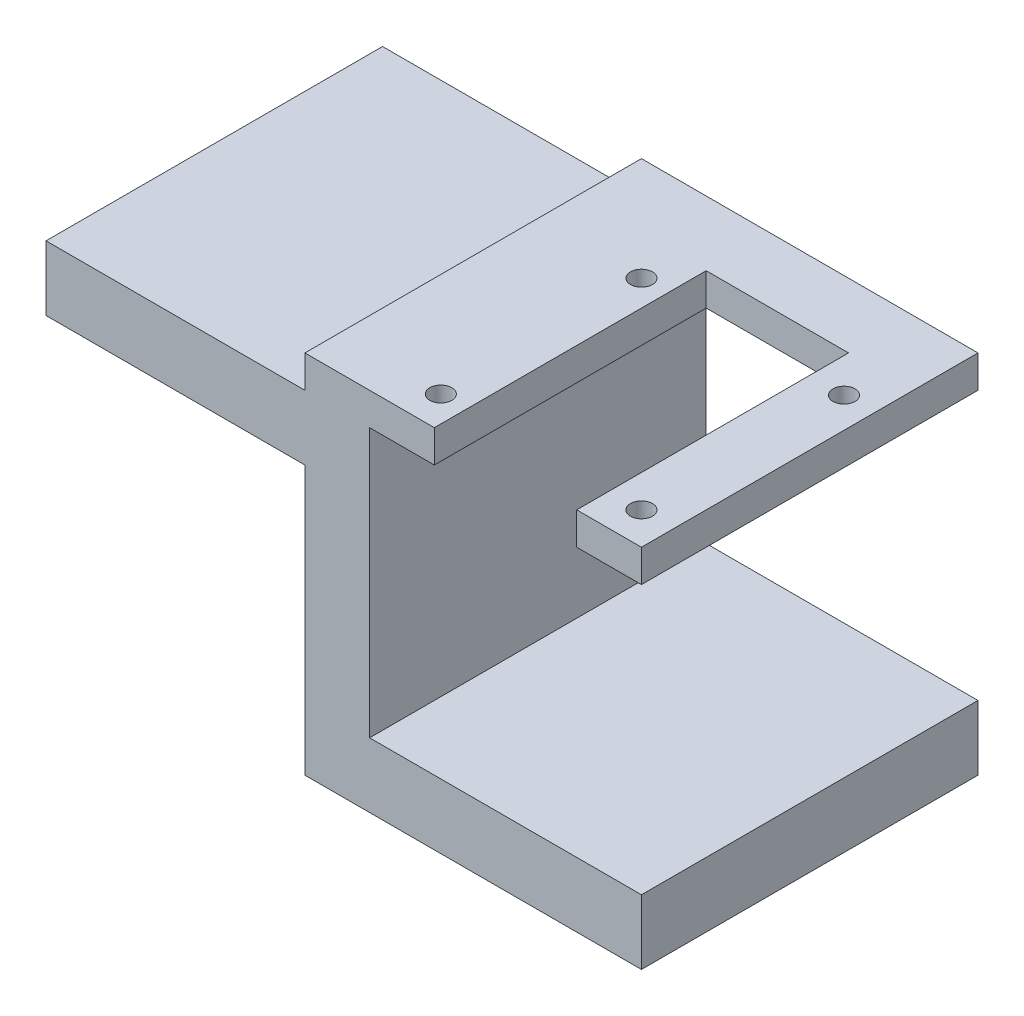
ISO-10303-21;
HEADER;
FILE_DESCRIPTION(('STEP AP214'),'2;1');
FILE_NAME('part.step','',(''),(''),'','','');
FILE_SCHEMA(('AUTOMOTIVE_DESIGN { 1 0 10303 214 1 1 1 1 }'));
ENDSEC;
DATA;
#1=APPLICATION_CONTEXT('core data for automotive mechanical design processes');
#2=APPLICATION_PROTOCOL_DEFINITION('international standard','automotive_design',2000,#1);
#3=PRODUCT_CONTEXT('',#1,'mechanical');
#4=PRODUCT('Part','Part','',(#3));
#5=PRODUCT_RELATED_PRODUCT_CATEGORY('part','',(#4));
#6=PRODUCT_DEFINITION_FORMATION('','',#4);
#7=PRODUCT_DEFINITION_CONTEXT('part definition',#1,'design');
#8=PRODUCT_DEFINITION('design','',#6,#7);
#9=PRODUCT_DEFINITION_SHAPE('','',#8);
#10=(LENGTH_UNIT() NAMED_UNIT(*) SI_UNIT(.MILLI.,.METRE.));
#11=(NAMED_UNIT(*) PLANE_ANGLE_UNIT() SI_UNIT($,.RADIAN.));
#12=(NAMED_UNIT(*) SI_UNIT($,.STERADIAN.) SOLID_ANGLE_UNIT());
#13=UNCERTAINTY_MEASURE_WITH_UNIT(LENGTH_MEASURE(1.E-05),#10,'distance_accuracy_value','');
#14=(GEOMETRIC_REPRESENTATION_CONTEXT(3) GLOBAL_UNCERTAINTY_ASSIGNED_CONTEXT((#13)) GLOBAL_UNIT_ASSIGNED_CONTEXT((#10,
#11,#12)) REPRESENTATION_CONTEXT('',''));
#15=CARTESIAN_POINT('',(0.,0.,0.));
#16=DIRECTION('',(0.,0.,1.));
#17=DIRECTION('',(1.,0.,0.));
#18=AXIS2_PLACEMENT_3D('',#15,#16,#17);
#19=CARTESIAN_POINT('',(-65.,0.,10.));
#20=DIRECTION('',(-1.,0.,0.));
#21=DIRECTION('',(0.,0.,1.));
#22=AXIS2_PLACEMENT_3D('',#19,#20,#21);
#23=PLANE('',#22);
#24=DIRECTION('',(0.,1.,0.));
#25=VECTOR('',#24,1.);
#26=CARTESIAN_POINT('',(-65.,0.,0.));
#27=LINE('',#26,#25);
#28=CARTESIAN_POINT('',(-65.,-35.,0.));
#29=VERTEX_POINT('',#28);
#30=CARTESIAN_POINT('',(-65.,0.,0.));
#31=VERTEX_POINT('',#30);
#32=EDGE_CURVE('E428',#29,#31,#27,.T.);
#33=ORIENTED_EDGE('',*,*,#32,.F.);
#34=DIRECTION('',(0.,0.,-1.));
#35=VECTOR('',#34,1.);
#36=CARTESIAN_POINT('',(-65.,-35.,10.));
#37=LINE('',#36,#35);
#38=CARTESIAN_POINT('',(-65.,-35.,10.));
#39=VERTEX_POINT('',#38);
#40=EDGE_CURVE('E12',#39,#29,#37,.T.);
#41=ORIENTED_EDGE('',*,*,#40,.F.);
#42=DIRECTION('',(0.,1.,0.));
#43=VECTOR('',#42,1.);
#44=CARTESIAN_POINT('',(-65.,0.,10.));
#45=LINE('',#44,#43);
#46=CARTESIAN_POINT('',(-65.,-10.,10.));
#47=VERTEX_POINT('',#46);
#48=EDGE_CURVE('E415',#39,#47,#45,.T.);
#49=ORIENTED_EDGE('',*,*,#48,.T.);
#50=DIRECTION('',(0.,0.,-1.));
#51=VECTOR('',#50,1.);
#52=CARTESIAN_POINT('',(-65.,-10.,52.));
#53=LINE('',#52,#51);
#54=CARTESIAN_POINT('',(-65.,-10.,52.));
#55=VERTEX_POINT('',#54);
#56=EDGE_CURVE('E123',#55,#47,#53,.T.);
#57=ORIENTED_EDGE('',*,*,#56,.F.);
#58=DIRECTION('',(0.,1.,0.));
#59=VECTOR('',#58,1.);
#60=CARTESIAN_POINT('',(-65.,0.,52.));
#61=LINE('',#60,#59);
#62=CARTESIAN_POINT('',(-65.,0.,52.));
#63=VERTEX_POINT('',#62);
#64=EDGE_CURVE('E319',#55,#63,#61,.T.);
#65=ORIENTED_EDGE('',*,*,#64,.T.);
#66=DIRECTION('',(0.,0.,-1.));
#67=VECTOR('',#66,1.);
#68=CARTESIAN_POINT('',(-65.,0.,52.));
#69=LINE('',#68,#67);
#70=EDGE_CURVE('E368',#63,#31,#69,.T.);
#71=ORIENTED_EDGE('',*,*,#70,.T.);
#72=EDGE_LOOP('',(#33,#41,#49,#57,#65,#71));
#73=FACE_BOUND('',#72,.T.);
#74=ADVANCED_FACE('F92',(#73),#23,.T.);
#75=CARTESIAN_POINT('',(-55.,-22.5,10.));
#76=DIRECTION('',(0.,0.,-1.));
#77=DIRECTION('',(-1.,0.,0.));
#78=AXIS2_PLACEMENT_3D('',#75,#76,#77);
#79=CYLINDRICAL_SURFACE('',#78,2.7);
#80=CARTESIAN_POINT('',(-55.,-22.5,10.));
#81=DIRECTION('',(0.,0.,1.));
#82=DIRECTION('',(1.,0.,0.));
#83=AXIS2_PLACEMENT_3D('',#80,#81,#82);
#84=CIRCLE('',#83,2.7);
#85=CARTESIAN_POINT('',(-52.3,-22.5,10.));
#86=VERTEX_POINT('',#85);
#87=EDGE_CURVE('E405',#86,#86,#84,.T.);
#88=ORIENTED_EDGE('',*,*,#87,.T.);
#89=EDGE_LOOP('',(#88));
#90=FACE_BOUND('',#89,.T.);
#91=CARTESIAN_POINT('',(-55.,-22.5,0.));
#92=DIRECTION('',(0.,0.,1.));
#93=DIRECTION('',(1.,0.,0.));
#94=AXIS2_PLACEMENT_3D('',#91,#92,#93);
#95=CIRCLE('',#94,2.7);
#96=CARTESIAN_POINT('',(-52.3,-22.5,0.));
#97=VERTEX_POINT('',#96);
#98=EDGE_CURVE('E424',#97,#97,#95,.T.);
#99=ORIENTED_EDGE('',*,*,#98,.F.);
#100=EDGE_LOOP('',(#99));
#101=FACE_BOUND('',#100,.T.);
#102=ADVANCED_FACE('F501',(#90,#101),#79,.F.);
#103=CARTESIAN_POINT('',(-35.,-22.5,10.));
#104=DIRECTION('',(0.,0.,-1.));
#105=DIRECTION('',(-1.,0.,0.));
#106=AXIS2_PLACEMENT_3D('',#103,#104,#105);
#107=CYLINDRICAL_SURFACE('',#106,2.7);
#108=CARTESIAN_POINT('',(-35.,-22.5,10.));
#109=DIRECTION('',(0.,0.,1.));
#110=DIRECTION('',(1.,0.,0.));
#111=AXIS2_PLACEMENT_3D('',#108,#109,#110);
#112=CIRCLE('',#111,2.7);
#113=CARTESIAN_POINT('',(-32.3,-22.5,10.));
#114=VERTEX_POINT('',#113);
#115=EDGE_CURVE('E401',#114,#114,#112,.T.);
#116=ORIENTED_EDGE('',*,*,#115,.T.);
#117=EDGE_LOOP('',(#116));
#118=FACE_BOUND('',#117,.T.);
#119=CARTESIAN_POINT('',(-35.,-22.5,0.));
#120=DIRECTION('',(0.,0.,1.));
#121=DIRECTION('',(1.,0.,0.));
#122=AXIS2_PLACEMENT_3D('',#119,#120,#121);
#123=CIRCLE('',#122,2.7);
#124=CARTESIAN_POINT('',(-32.3,-22.5,0.));
#125=VERTEX_POINT('',#124);
#126=EDGE_CURVE('E400',#125,#125,#123,.T.);
#127=ORIENTED_EDGE('',*,*,#126,.F.);
#128=EDGE_LOOP('',(#127));
#129=FACE_BOUND('',#128,.T.);
#130=ADVANCED_FACE('F94',(#118,#129),#107,.F.);
#131=CARTESIAN_POINT('',(0.,-35.,10.));
#132=DIRECTION('',(0.,-1.,0.));
#133=DIRECTION('',(1.,0.,0.));
#134=AXIS2_PLACEMENT_3D('',#131,#132,#133);
#135=PLANE('',#134);
#136=DIRECTION('',(-1.,0.,0.));
#137=VECTOR('',#136,1.);
#138=CARTESIAN_POINT('',(0.,-35.,0.));
#139=LINE('',#138,#137);
#140=CARTESIAN_POINT('',(-25.,-35.,0.));
#141=VERTEX_POINT('',#140);
#142=EDGE_CURVE('E406',#141,#29,#139,.T.);
#143=ORIENTED_EDGE('',*,*,#142,.F.);
#144=DIRECTION('',(0.,0.,-1.));
#145=VECTOR('',#144,1.);
#146=CARTESIAN_POINT('',(-25.,-35.,10.));
#147=LINE('',#146,#145);
#148=CARTESIAN_POINT('',(-25.,-35.,10.));
#149=VERTEX_POINT('',#148);
#150=EDGE_CURVE('E102',#149,#141,#147,.T.);
#151=ORIENTED_EDGE('',*,*,#150,.F.);
#152=DIRECTION('',(-1.,0.,0.));
#153=VECTOR('',#152,1.);
#154=CARTESIAN_POINT('',(0.,-35.,10.));
#155=LINE('',#154,#153);
#156=EDGE_CURVE('E418',#149,#39,#155,.T.);
#157=ORIENTED_EDGE('',*,*,#156,.T.);
#158=ORIENTED_EDGE('',*,*,#40,.T.);
#159=EDGE_LOOP('',(#143,#151,#157,#158));
#160=FACE_BOUND('',#159,.T.);
#161=ADVANCED_FACE('F437',(#160),#135,.T.);
#162=CARTESIAN_POINT('',(0.,0.,10.));
#163=DIRECTION('',(0.,0.,1.));
#164=DIRECTION('',(1.,0.,0.));
#165=AXIS2_PLACEMENT_3D('',#162,#163,#164);
#166=PLANE('',#165);
#167=ORIENTED_EDGE('',*,*,#115,.F.);
#168=EDGE_LOOP('',(#167));
#169=FACE_BOUND('',#168,.T.);
#170=ORIENTED_EDGE('',*,*,#87,.F.);
#171=EDGE_LOOP('',(#170));
#172=FACE_BOUND('',#171,.T.);
#173=DIRECTION('',(0.,-1.,0.));
#174=VECTOR('',#173,1.);
#175=CARTESIAN_POINT('',(-25.,0.,10.));
#176=LINE('',#175,#174);
#177=CARTESIAN_POINT('',(-25.,-10.,10.));
#178=VERTEX_POINT('',#177);
#179=EDGE_CURVE('E131',#178,#149,#176,.T.);
#180=ORIENTED_EDGE('',*,*,#179,.F.);
#181=DIRECTION('',(-1.,0.,0.));
#182=VECTOR('',#181,1.);
#183=CARTESIAN_POINT('',(0.,-9.99999999999999,10.));
#184=LINE('',#183,#182);
#185=EDGE_CURVE('E412',#178,#47,#184,.T.);
#186=ORIENTED_EDGE('',*,*,#185,.T.);
#187=ORIENTED_EDGE('',*,*,#48,.F.);
#188=ORIENTED_EDGE('',*,*,#156,.F.);
#189=EDGE_LOOP('',(#180,#186,#187,#188));
#190=FACE_BOUND('',#189,.T.);
#191=ADVANCED_FACE('F456',(#169,#172,#190),#166,.T.);
#192=CARTESIAN_POINT('',(0.,0.,0.));
#193=DIRECTION('',(0.,0.,1.));
#194=DIRECTION('',(1.,0.,0.));
#195=AXIS2_PLACEMENT_3D('',#192,#193,#194);
#196=PLANE('',#195);
#197=ORIENTED_EDGE('',*,*,#32,.T.);
#198=DIRECTION('',(-1.,0.,0.));
#199=VECTOR('',#198,1.);
#200=CARTESIAN_POINT('',(0.,0.,0.));
#201=LINE('',#200,#199);
#202=CARTESIAN_POINT('',(-25.,0.,0.));
#203=VERTEX_POINT('',#202);
#204=EDGE_CURVE('E355',#203,#31,#201,.T.);
#205=ORIENTED_EDGE('',*,*,#204,.F.);
#206=DIRECTION('',(0.,-1.,0.));
#207=VECTOR('',#206,1.);
#208=CARTESIAN_POINT('',(-25.,-2.7755575615629E-13,0.));
#209=LINE('',#208,#207);
#210=CARTESIAN_POINT('',(-25.,4.99999999999997,0.));
#211=VERTEX_POINT('',#210);
#212=EDGE_CURVE('E352',#211,#203,#209,.T.);
#213=ORIENTED_EDGE('',*,*,#212,.F.);
#214=DIRECTION('',(1.,0.,0.));
#215=VECTOR('',#214,1.);
#216=CARTESIAN_POINT('',(0.,5.00000000000003,0.));
#217=LINE('',#216,#215);
#218=CARTESIAN_POINT('',(27.,4.99999999999999,0.));
#219=VERTEX_POINT('',#218);
#220=EDGE_CURVE('E349',#211,#219,#217,.T.);
#221=ORIENTED_EDGE('',*,*,#220,.T.);
#222=DIRECTION('',(0.,-1.,0.));
#223=VECTOR('',#222,1.);
#224=CARTESIAN_POINT('',(27.,0.,0.));
#225=LINE('',#224,#223);
#226=CARTESIAN_POINT('',(27.,0.,0.));
#227=VERTEX_POINT('',#226);
#228=EDGE_CURVE('E249',#219,#227,#225,.T.);
#229=ORIENTED_EDGE('',*,*,#228,.T.);
#230=DIRECTION('',(-1.,0.,0.));
#231=VECTOR('',#230,1.);
#232=CARTESIAN_POINT('',(0.,0.,0.));
#233=LINE('',#232,#231);
#234=CARTESIAN_POINT('',(-15.,0.,0.));
#235=VERTEX_POINT('',#234);
#236=EDGE_CURVE('E345',#227,#235,#233,.T.);
#237=ORIENTED_EDGE('',*,*,#236,.T.);
#238=DIRECTION('',(0.,1.,0.));
#239=VECTOR('',#238,1.);
#240=CARTESIAN_POINT('',(-15.,0.,0.));
#241=LINE('',#240,#239);
#242=CARTESIAN_POINT('',(-15.,-41.5017635277103,0.));
#243=VERTEX_POINT('',#242);
#244=EDGE_CURVE('E341',#243,#235,#241,.T.);
#245=ORIENTED_EDGE('',*,*,#244,.F.);
#246=DIRECTION('',(-1.,0.,0.));
#247=VECTOR('',#246,1.);
#248=CARTESIAN_POINT('',(0.,-41.5017635277103,0.));
#249=LINE('',#248,#247);
#250=CARTESIAN_POINT('',(27.0000000000001,-41.5017635277103,0.));
#251=VERTEX_POINT('',#250);
#252=EDGE_CURVE('E338',#251,#243,#249,.T.);
#253=ORIENTED_EDGE('',*,*,#252,.F.);
#254=DIRECTION('',(0.,-1.,0.));
#255=VECTOR('',#254,1.);
#256=CARTESIAN_POINT('',(27.0000000000001,0.,0.));
#257=LINE('',#256,#255);
#258=CARTESIAN_POINT('',(27.0000000000001,-51.5017635277103,0.));
#259=VERTEX_POINT('',#258);
#260=EDGE_CURVE('E334',#251,#259,#257,.T.);
#261=ORIENTED_EDGE('',*,*,#260,.T.);
#262=DIRECTION('',(-1.,0.,0.));
#263=VECTOR('',#262,1.);
#264=CARTESIAN_POINT('',(0.,-51.5017635277103,0.));
#265=LINE('',#264,#263);
#266=CARTESIAN_POINT('',(-24.9999999999999,-51.5017635277103,0.));
#267=VERTEX_POINT('',#266);
#268=EDGE_CURVE('E286',#259,#267,#265,.T.);
#269=ORIENTED_EDGE('',*,*,#268,.T.);
#270=DIRECTION('',(0.,1.,0.));
#271=VECTOR('',#270,1.);
#272=CARTESIAN_POINT('',(-25.,0.,0.));
#273=LINE('',#272,#271);
#274=EDGE_CURVE('E292',#267,#141,#273,.T.);
#275=ORIENTED_EDGE('',*,*,#274,.T.);
#276=ORIENTED_EDGE('',*,*,#142,.T.);
#277=EDGE_LOOP('',(#197,#205,#213,#221,#229,#237,#245,#253,#261,#269,#275,#276));
#278=FACE_BOUND('',#277,.T.);
#279=ORIENTED_EDGE('',*,*,#126,.T.);
#280=EDGE_LOOP('',(#279));
#281=FACE_BOUND('',#280,.T.);
#282=ORIENTED_EDGE('',*,*,#98,.T.);
#283=EDGE_LOOP('',(#282));
#284=FACE_BOUND('',#283,.T.);
#285=ADVANCED_FACE('F439',(#278,#281,#284),#196,.F.);
#286=CARTESIAN_POINT('',(0.,-51.5017635277103,52.));
#287=DIRECTION('',(0.,-1.,0.));
#288=DIRECTION('',(1.,0.,0.));
#289=AXIS2_PLACEMENT_3D('',#286,#287,#288);
#290=PLANE('',#289);
#291=ORIENTED_EDGE('',*,*,#268,.F.);
#292=DIRECTION('',(0.,0.,-1.));
#293=VECTOR('',#292,1.);
#294=CARTESIAN_POINT('',(27.0000000000001,-51.5017635277103,52.));
#295=LINE('',#294,#293);
#296=CARTESIAN_POINT('',(27.0000000000001,-51.5017635277103,52.));
#297=VERTEX_POINT('',#296);
#298=EDGE_CURVE('E397',#297,#259,#295,.T.);
#299=ORIENTED_EDGE('',*,*,#298,.F.);
#300=DIRECTION('',(-1.,0.,0.));
#301=VECTOR('',#300,1.);
#302=CARTESIAN_POINT('',(0.,-51.5017635277103,52.));
#303=LINE('',#302,#301);
#304=CARTESIAN_POINT('',(-24.9999999999999,-51.5017635277103,52.));
#305=VERTEX_POINT('',#304);
#306=EDGE_CURVE('E287',#297,#305,#303,.T.);
#307=ORIENTED_EDGE('',*,*,#306,.T.);
#308=DIRECTION('',(0.,0.,-1.));
#309=VECTOR('',#308,1.);
#310=CARTESIAN_POINT('',(-24.9999999999999,-51.5017635277103,52.));
#311=LINE('',#310,#309);
#312=EDGE_CURVE('E330',#305,#267,#311,.T.);
#313=ORIENTED_EDGE('',*,*,#312,.T.);
#314=EDGE_LOOP('',(#291,#299,#307,#313));
#315=FACE_BOUND('',#314,.T.);
#316=ADVANCED_FACE('F446',(#315),#290,.T.);
#317=CARTESIAN_POINT('',(27.0000000000001,0.,52.));
#318=DIRECTION('',(1.,0.,0.));
#319=DIRECTION('',(0.,1.,0.));
#320=AXIS2_PLACEMENT_3D('',#317,#318,#319);
#321=PLANE('',#320);
#322=ORIENTED_EDGE('',*,*,#260,.F.);
#323=DIRECTION('',(0.,0.,-1.));
#324=VECTOR('',#323,1.);
#325=CARTESIAN_POINT('',(27.0000000000001,-41.5017635277103,52.));
#326=LINE('',#325,#324);
#327=CARTESIAN_POINT('',(27.0000000000001,-41.5017635277103,52.));
#328=VERTEX_POINT('',#327);
#329=EDGE_CURVE('E394',#328,#251,#326,.T.);
#330=ORIENTED_EDGE('',*,*,#329,.F.);
#331=DIRECTION('',(0.,-1.,0.));
#332=VECTOR('',#331,1.);
#333=CARTESIAN_POINT('',(27.0000000000001,0.,52.));
#334=LINE('',#333,#332);
#335=EDGE_CURVE('E291',#328,#297,#334,.T.);
#336=ORIENTED_EDGE('',*,*,#335,.T.);
#337=ORIENTED_EDGE('',*,*,#298,.T.);
#338=EDGE_LOOP('',(#322,#330,#336,#337));
#339=FACE_BOUND('',#338,.T.);
#340=ADVANCED_FACE('F482',(#339),#321,.T.);
#341=CARTESIAN_POINT('',(0.,-41.5017635277103,52.));
#342=DIRECTION('',(0.,-1.,0.));
#343=DIRECTION('',(1.,0.,0.));
#344=AXIS2_PLACEMENT_3D('',#341,#342,#343);
#345=PLANE('',#344);
#346=ORIENTED_EDGE('',*,*,#252,.T.);
#347=DIRECTION('',(0.,0.,-1.));
#348=VECTOR('',#347,1.);
#349=CARTESIAN_POINT('',(-15.,-41.5017635277103,52.));
#350=LINE('',#349,#348);
#351=CARTESIAN_POINT('',(-15.,-41.5017635277103,52.));
#352=VERTEX_POINT('',#351);
#353=EDGE_CURVE('E390',#352,#243,#350,.T.);
#354=ORIENTED_EDGE('',*,*,#353,.F.);
#355=DIRECTION('',(-1.,0.,0.));
#356=VECTOR('',#355,1.);
#357=CARTESIAN_POINT('',(0.,-41.5017635277103,52.));
#358=LINE('',#357,#356);
#359=EDGE_CURVE('E296',#328,#352,#358,.T.);
#360=ORIENTED_EDGE('',*,*,#359,.F.);
#361=ORIENTED_EDGE('',*,*,#329,.T.);
#362=EDGE_LOOP('',(#346,#354,#360,#361));
#363=FACE_BOUND('',#362,.T.);
#364=ADVANCED_FACE('F480',(#363),#345,.F.);
#365=CARTESIAN_POINT('',(-15.,0.,52.));
#366=DIRECTION('',(-1.,0.,0.));
#367=DIRECTION('',(0.,0.,1.));
#368=AXIS2_PLACEMENT_3D('',#365,#366,#367);
#369=PLANE('',#368);
#370=ORIENTED_EDGE('',*,*,#244,.T.);
#371=DIRECTION('',(0.,0.,-1.));
#372=VECTOR('',#371,1.);
#373=CARTESIAN_POINT('',(-15.,0.,52.));
#374=LINE('',#373,#372);
#375=CARTESIAN_POINT('',(-15.,0.,52.));
#376=VERTEX_POINT('',#375);
#377=EDGE_CURVE('E387',#376,#235,#374,.T.);
#378=ORIENTED_EDGE('',*,*,#377,.F.);
#379=DIRECTION('',(0.,1.,0.));
#380=VECTOR('',#379,1.);
#381=CARTESIAN_POINT('',(-15.,0.,52.));
#382=LINE('',#381,#380);
#383=EDGE_CURVE('E299',#352,#376,#382,.T.);
#384=ORIENTED_EDGE('',*,*,#383,.F.);
#385=ORIENTED_EDGE('',*,*,#353,.T.);
#386=EDGE_LOOP('',(#370,#378,#384,#385));
#387=FACE_BOUND('',#386,.T.);
#388=ADVANCED_FACE('F476',(#387),#369,.F.);
#389=CARTESIAN_POINT('',(0.,0.,52.));
#390=DIRECTION('',(0.,-1.,0.));
#391=DIRECTION('',(1.,0.,0.));
#392=AXIS2_PLACEMENT_3D('',#389,#390,#391);
#393=PLANE('',#392);
#394=CARTESIAN_POINT('',(22.2968505920888,0.,16.));
#395=DIRECTION('',(0.,-1.,0.));
#396=DIRECTION('',(1.,0.,0.));
#397=AXIS2_PLACEMENT_3D('',#394,#395,#396);
#398=CIRCLE('',#397,1.7);
#399=CARTESIAN_POINT('',(23.9968505920888,0.,16.));
#400=VERTEX_POINT('',#399);
#401=EDGE_CURVE('E878',#400,#400,#398,.F.);
#402=ORIENTED_EDGE('',*,*,#401,.T.);
#403=EDGE_LOOP('',(#402));
#404=FACE_BOUND('',#403,.T.);
#405=CARTESIAN_POINT('',(-9.,0.,47.));
#406=DIRECTION('',(0.,-1.,0.));
#407=DIRECTION('',(1.,0.,0.));
#408=AXIS2_PLACEMENT_3D('',#405,#406,#407);
#409=CIRCLE('',#408,1.7);
#410=CARTESIAN_POINT('',(-7.3,0.,47.));
#411=VERTEX_POINT('',#410);
#412=EDGE_CURVE('E897',#411,#411,#409,.F.);
#413=ORIENTED_EDGE('',*,*,#412,.T.);
#414=EDGE_LOOP('',(#413));
#415=FACE_BOUND('',#414,.T.);
#416=CARTESIAN_POINT('',(-9.,0.,16.));
#417=DIRECTION('',(0.,-1.,0.));
#418=DIRECTION('',(1.,0.,0.));
#419=AXIS2_PLACEMENT_3D('',#416,#417,#418);
#420=CIRCLE('',#419,1.7);
#421=CARTESIAN_POINT('',(-7.3,0.,16.));
#422=VERTEX_POINT('',#421);
#423=EDGE_CURVE('E891',#422,#422,#420,.F.);
#424=ORIENTED_EDGE('',*,*,#423,.T.);
#425=EDGE_LOOP('',(#424));
#426=FACE_BOUND('',#425,.T.);
#427=CARTESIAN_POINT('',(22.,0.,47.));
#428=DIRECTION('',(0.,-1.,0.));
#429=DIRECTION('',(1.,0.,0.));
#430=AXIS2_PLACEMENT_3D('',#427,#428,#429);
#431=CIRCLE('',#430,1.7);
#432=CARTESIAN_POINT('',(23.7,0.,47.));
#433=VERTEX_POINT('',#432);
#434=EDGE_CURVE('E266',#433,#433,#431,.F.);
#435=ORIENTED_EDGE('',*,*,#434,.T.);
#436=EDGE_LOOP('',(#435));
#437=FACE_BOUND('',#436,.T.);
#438=ORIENTED_EDGE('',*,*,#236,.F.);
#439=DIRECTION('',(0.,0.,-1.));
#440=VECTOR('',#439,1.);
#441=CARTESIAN_POINT('',(27.,0.,52.));
#442=LINE('',#441,#440);
#443=CARTESIAN_POINT('',(27.,0.,52.));
#444=VERTEX_POINT('',#443);
#445=EDGE_CURVE('E237',#444,#227,#442,.T.);
#446=ORIENTED_EDGE('',*,*,#445,.F.);
#447=DIRECTION('',(-1.,0.,0.));
#448=VECTOR('',#447,1.);
#449=CARTESIAN_POINT('',(0.,0.,52.));
#450=LINE('',#449,#448);
#451=CARTESIAN_POINT('',(17.,0.,52.));
#452=VERTEX_POINT('',#451);
#453=EDGE_CURVE('E243',#444,#452,#450,.T.);
#454=ORIENTED_EDGE('',*,*,#453,.T.);
#455=DIRECTION('',(0.,0.,-1.));
#456=VECTOR('',#455,1.);
#457=CARTESIAN_POINT('',(17.,0.,52.));
#458=LINE('',#457,#456);
#459=CARTESIAN_POINT('',(17.,0.,10.));
#460=VERTEX_POINT('',#459);
#461=EDGE_CURVE('E226',#452,#460,#458,.T.);
#462=ORIENTED_EDGE('',*,*,#461,.T.);
#463=DIRECTION('',(-1.,0.,0.));
#464=VECTOR('',#463,1.);
#465=CARTESIAN_POINT('',(0.,0.,10.));
#466=LINE('',#465,#464);
#467=CARTESIAN_POINT('',(-4.99999999999994,0.,10.));
#468=VERTEX_POINT('',#467);
#469=EDGE_CURVE('E236',#460,#468,#466,.T.);
#470=ORIENTED_EDGE('',*,*,#469,.T.);
#471=DIRECTION('',(0.,0.,-1.));
#472=VECTOR('',#471,1.);
#473=CARTESIAN_POINT('',(-4.99999999999994,0.,52.));
#474=LINE('',#473,#472);
#475=CARTESIAN_POINT('',(-4.99999999999994,0.,52.));
#476=VERTEX_POINT('',#475);
#477=EDGE_CURVE('E383',#476,#468,#474,.T.);
#478=ORIENTED_EDGE('',*,*,#477,.F.);
#479=DIRECTION('',(-1.,0.,0.));
#480=VECTOR('',#479,1.);
#481=CARTESIAN_POINT('',(0.,0.,52.));
#482=LINE('',#481,#480);
#483=EDGE_CURVE('E302',#476,#376,#482,.T.);
#484=ORIENTED_EDGE('',*,*,#483,.T.);
#485=ORIENTED_EDGE('',*,*,#377,.T.);
#486=EDGE_LOOP('',(#438,#446,#454,#462,#470,#478,#484,#485));
#487=FACE_BOUND('',#486,.T.);
#488=ADVANCED_FACE('F251',(#404,#415,#426,#437,#487),#393,.T.);
#489=CARTESIAN_POINT('',(-4.99999999999994,0.,52.));
#490=DIRECTION('',(-1.,0.,0.));
#491=DIRECTION('',(0.,0.,1.));
#492=AXIS2_PLACEMENT_3D('',#489,#490,#491);
#493=PLANE('',#492);
#494=ORIENTED_EDGE('',*,*,#477,.T.);
#495=DIRECTION('',(0.,1.,0.));
#496=VECTOR('',#495,1.);
#497=CARTESIAN_POINT('',(-4.99999999999994,0.,10.));
#498=LINE('',#497,#496);
#499=CARTESIAN_POINT('',(-4.99999999999994,4.99999999999999,10.));
#500=VERTEX_POINT('',#499);
#501=EDGE_CURVE('E282',#468,#500,#498,.T.);
#502=ORIENTED_EDGE('',*,*,#501,.T.);
#503=DIRECTION('',(0.,0.,-1.));
#504=VECTOR('',#503,1.);
#505=CARTESIAN_POINT('',(-4.99999999999994,4.99999999999999,52.));
#506=LINE('',#505,#504);
#507=CARTESIAN_POINT('',(-4.99999999999994,4.99999999999999,52.));
#508=VERTEX_POINT('',#507);
#509=EDGE_CURVE('E379',#508,#500,#506,.T.);
#510=ORIENTED_EDGE('',*,*,#509,.F.);
#511=DIRECTION('',(0.,1.,0.));
#512=VECTOR('',#511,1.);
#513=CARTESIAN_POINT('',(-4.99999999999994,0.,52.));
#514=LINE('',#513,#512);
#515=EDGE_CURVE('E306',#476,#508,#514,.T.);
#516=ORIENTED_EDGE('',*,*,#515,.F.);
#517=EDGE_LOOP('',(#494,#502,#510,#516));
#518=FACE_BOUND('',#517,.T.);
#519=ADVANCED_FACE('F487',(#518),#493,.F.);
#520=CARTESIAN_POINT('',(0.,5.00000000000003,52.));
#521=DIRECTION('',(0.,1.,0.));
#522=DIRECTION('',(-1.,0.,0.));
#523=AXIS2_PLACEMENT_3D('',#520,#521,#522);
#524=PLANE('',#523);
#525=CARTESIAN_POINT('',(22.2968505920888,5.00000000000008,16.));
#526=DIRECTION('',(0.,1.,0.));
#527=DIRECTION('',(-1.,0.,0.));
#528=AXIS2_PLACEMENT_3D('',#525,#526,#527);
#529=CIRCLE('',#528,1.7);
#530=CARTESIAN_POINT('',(20.5968505920888,5.00000000000007,16.));
#531=VERTEX_POINT('',#530);
#532=EDGE_CURVE('E881',#531,#531,#529,.T.);
#533=ORIENTED_EDGE('',*,*,#532,.F.);
#534=EDGE_LOOP('',(#533));
#535=FACE_BOUND('',#534,.T.);
#536=CARTESIAN_POINT('',(-9.00000000000001,5.00000000000001,47.));
#537=DIRECTION('',(0.,1.,0.));
#538=DIRECTION('',(-1.,0.,0.));
#539=AXIS2_PLACEMENT_3D('',#536,#537,#538);
#540=CIRCLE('',#539,1.7);
#541=CARTESIAN_POINT('',(-10.7,5.,47.));
#542=VERTEX_POINT('',#541);
#543=EDGE_CURVE('E888',#542,#542,#540,.T.);
#544=ORIENTED_EDGE('',*,*,#543,.F.);
#545=EDGE_LOOP('',(#544));
#546=FACE_BOUND('',#545,.T.);
#547=CARTESIAN_POINT('',(-9.00000000000001,5.00000000000001,16.));
#548=DIRECTION('',(0.,1.,0.));
#549=DIRECTION('',(-1.,0.,0.));
#550=AXIS2_PLACEMENT_3D('',#547,#548,#549);
#551=CIRCLE('',#550,1.7);
#552=CARTESIAN_POINT('',(-10.7,5.,16.));
#553=VERTEX_POINT('',#552);
#554=EDGE_CURVE('E901',#553,#553,#551,.T.);
#555=ORIENTED_EDGE('',*,*,#554,.F.);
#556=EDGE_LOOP('',(#555));
#557=FACE_BOUND('',#556,.T.);
#558=CARTESIAN_POINT('',(22.,5.00000000000008,47.));
#559=DIRECTION('',(0.,1.,0.));
#560=DIRECTION('',(-1.,0.,0.));
#561=AXIS2_PLACEMENT_3D('',#558,#559,#560);
#562=CIRCLE('',#561,1.7);
#563=CARTESIAN_POINT('',(20.3,5.00000000000007,47.));
#564=VERTEX_POINT('',#563);
#565=EDGE_CURVE('E883',#564,#564,#562,.T.);
#566=ORIENTED_EDGE('',*,*,#565,.F.);
#567=EDGE_LOOP('',(#566));
#568=FACE_BOUND('',#567,.T.);
#569=ORIENTED_EDGE('',*,*,#220,.F.);
#570=DIRECTION('',(0.,0.,-1.));
#571=VECTOR('',#570,1.);
#572=CARTESIAN_POINT('',(-25.,4.99999999999997,52.));
#573=LINE('',#572,#571);
#574=CARTESIAN_POINT('',(-25.,4.99999999999997,52.));
#575=VERTEX_POINT('',#574);
#576=EDGE_CURVE('E376',#575,#211,#573,.T.);
#577=ORIENTED_EDGE('',*,*,#576,.F.);
#578=DIRECTION('',(1.,0.,0.));
#579=VECTOR('',#578,1.);
#580=CARTESIAN_POINT('',(0.,5.00000000000003,52.));
#581=LINE('',#580,#579);
#582=EDGE_CURVE('E309',#575,#508,#581,.T.);
#583=ORIENTED_EDGE('',*,*,#582,.T.);
#584=ORIENTED_EDGE('',*,*,#509,.T.);
#585=DIRECTION('',(-1.,0.,0.));
#586=VECTOR('',#585,1.);
#587=CARTESIAN_POINT('',(0.,4.99999999999999,10.));
#588=LINE('',#587,#586);
#589=CARTESIAN_POINT('',(17.,4.99999999999999,10.));
#590=VERTEX_POINT('',#589);
#591=EDGE_CURVE('E279',#590,#500,#588,.T.);
#592=ORIENTED_EDGE('',*,*,#591,.F.);
#593=DIRECTION('',(0.,0.,-1.));
#594=VECTOR('',#593,1.);
#595=CARTESIAN_POINT('',(17.,4.99999999999999,52.));
#596=LINE('',#595,#594);
#597=CARTESIAN_POINT('',(17.,4.99999999999999,52.));
#598=VERTEX_POINT('',#597);
#599=EDGE_CURVE('E262',#598,#590,#596,.T.);
#600=ORIENTED_EDGE('',*,*,#599,.F.);
#601=DIRECTION('',(-1.,0.,0.));
#602=VECTOR('',#601,1.);
#603=CARTESIAN_POINT('',(0.,4.99999999999999,52.));
#604=LINE('',#603,#602);
#605=CARTESIAN_POINT('',(27.,4.99999999999999,52.));
#606=VERTEX_POINT('',#605);
#607=EDGE_CURVE('E246',#606,#598,#604,.T.);
#608=ORIENTED_EDGE('',*,*,#607,.F.);
#609=DIRECTION('',(0.,0.,-1.));
#610=VECTOR('',#609,1.);
#611=CARTESIAN_POINT('',(27.,4.99999999999999,52.));
#612=LINE('',#611,#610);
#613=EDGE_CURVE('E269',#606,#219,#612,.T.);
#614=ORIENTED_EDGE('',*,*,#613,.T.);
#615=EDGE_LOOP('',(#569,#577,#583,#584,#592,#600,#608,#614));
#616=FACE_BOUND('',#615,.T.);
#617=ADVANCED_FACE('F466',(#535,#546,#557,#568,#616),#524,.T.);
#618=CARTESIAN_POINT('',(-25.,-2.7755575615629E-13,52.));
#619=DIRECTION('',(1.,0.,0.));
#620=DIRECTION('',(0.,1.,0.));
#621=AXIS2_PLACEMENT_3D('',#618,#619,#620);
#622=PLANE('',#621);
#623=ORIENTED_EDGE('',*,*,#212,.T.);
#624=DIRECTION('',(0.,0.,-1.));
#625=VECTOR('',#624,1.);
#626=CARTESIAN_POINT('',(-25.,0.,52.));
#627=LINE('',#626,#625);
#628=CARTESIAN_POINT('',(-25.,0.,52.));
#629=VERTEX_POINT('',#628);
#630=EDGE_CURVE('E372',#629,#203,#627,.T.);
#631=ORIENTED_EDGE('',*,*,#630,.F.);
#632=DIRECTION('',(0.,-1.,0.));
#633=VECTOR('',#632,1.);
#634=CARTESIAN_POINT('',(-25.,-2.7755575615629E-13,52.));
#635=LINE('',#634,#633);
#636=EDGE_CURVE('E313',#575,#629,#635,.T.);
#637=ORIENTED_EDGE('',*,*,#636,.F.);
#638=ORIENTED_EDGE('',*,*,#576,.T.);
#639=EDGE_LOOP('',(#623,#631,#637,#638));
#640=FACE_BOUND('',#639,.T.);
#641=ADVANCED_FACE('F530',(#640),#622,.F.);
#642=CARTESIAN_POINT('',(0.,0.,52.));
#643=DIRECTION('',(0.,-1.,0.));
#644=DIRECTION('',(1.,0.,0.));
#645=AXIS2_PLACEMENT_3D('',#642,#643,#644);
#646=PLANE('',#645);
#647=ORIENTED_EDGE('',*,*,#204,.T.);
#648=ORIENTED_EDGE('',*,*,#70,.F.);
#649=DIRECTION('',(-1.,0.,0.));
#650=VECTOR('',#649,1.);
#651=CARTESIAN_POINT('',(0.,0.,52.));
#652=LINE('',#651,#650);
#653=EDGE_CURVE('E316',#629,#63,#652,.T.);
#654=ORIENTED_EDGE('',*,*,#653,.F.);
#655=ORIENTED_EDGE('',*,*,#630,.T.);
#656=EDGE_LOOP('',(#647,#648,#654,#655));
#657=FACE_BOUND('',#656,.T.);
#658=ADVANCED_FACE('F460',(#657),#646,.F.);
#659=CARTESIAN_POINT('',(0.,-9.99999999999999,52.));
#660=DIRECTION('',(0.,-1.,0.));
#661=DIRECTION('',(1.,0.,0.));
#662=AXIS2_PLACEMENT_3D('',#659,#660,#661);
#663=PLANE('',#662);
#664=ORIENTED_EDGE('',*,*,#56,.T.);
#665=ORIENTED_EDGE('',*,*,#185,.F.);
#666=DIRECTION('',(0.,0.,-1.));
#667=VECTOR('',#666,1.);
#668=CARTESIAN_POINT('',(-25.,-10.,52.));
#669=LINE('',#668,#667);
#670=CARTESIAN_POINT('',(-25.,-10.,52.));
#671=VERTEX_POINT('',#670);
#672=EDGE_CURVE('E363',#671,#178,#669,.T.);
#673=ORIENTED_EDGE('',*,*,#672,.F.);
#674=DIRECTION('',(-1.,0.,0.));
#675=VECTOR('',#674,1.);
#676=CARTESIAN_POINT('',(0.,-9.99999999999999,52.));
#677=LINE('',#676,#675);
#678=EDGE_CURVE('E323',#671,#55,#677,.T.);
#679=ORIENTED_EDGE('',*,*,#678,.T.);
#680=EDGE_LOOP('',(#664,#665,#673,#679));
#681=FACE_BOUND('',#680,.T.);
#682=ADVANCED_FACE('F454',(#681),#663,.T.);
#683=CARTESIAN_POINT('',(-25.,0.,52.));
#684=DIRECTION('',(-1.,0.,0.));
#685=DIRECTION('',(0.,-1.,0.));
#686=AXIS2_PLACEMENT_3D('',#683,#684,#685);
#687=PLANE('',#686);
#688=ORIENTED_EDGE('',*,*,#179,.T.);
#689=ORIENTED_EDGE('',*,*,#150,.T.);
#690=ORIENTED_EDGE('',*,*,#274,.F.);
#691=ORIENTED_EDGE('',*,*,#312,.F.);
#692=DIRECTION('',(0.,1.,0.));
#693=VECTOR('',#692,1.);
#694=CARTESIAN_POINT('',(-25.,0.,52.));
#695=LINE('',#694,#693);
#696=EDGE_CURVE('E326',#305,#671,#695,.T.);
#697=ORIENTED_EDGE('',*,*,#696,.T.);
#698=ORIENTED_EDGE('',*,*,#672,.T.);
#699=EDGE_LOOP('',(#688,#689,#690,#691,#697,#698));
#700=FACE_BOUND('',#699,.T.);
#701=ADVANCED_FACE('F435',(#700),#687,.T.);
#702=CARTESIAN_POINT('',(0.,0.,52.));
#703=DIRECTION('',(0.,0.,1.));
#704=DIRECTION('',(1.,0.,0.));
#705=AXIS2_PLACEMENT_3D('',#702,#703,#704);
#706=PLANE('',#705);
#707=ORIENTED_EDGE('',*,*,#306,.F.);
#708=ORIENTED_EDGE('',*,*,#335,.F.);
#709=ORIENTED_EDGE('',*,*,#359,.T.);
#710=ORIENTED_EDGE('',*,*,#383,.T.);
#711=ORIENTED_EDGE('',*,*,#483,.F.);
#712=ORIENTED_EDGE('',*,*,#515,.T.);
#713=ORIENTED_EDGE('',*,*,#582,.F.);
#714=ORIENTED_EDGE('',*,*,#636,.T.);
#715=ORIENTED_EDGE('',*,*,#653,.T.);
#716=ORIENTED_EDGE('',*,*,#64,.F.);
#717=ORIENTED_EDGE('',*,*,#678,.F.);
#718=ORIENTED_EDGE('',*,*,#696,.F.);
#719=EDGE_LOOP('',(#707,#708,#709,#710,#711,#712,#713,#714,#715,#716,#717,#718));
#720=FACE_BOUND('',#719,.T.);
#721=ADVANCED_FACE('F451',(#720),#706,.T.);
#722=CARTESIAN_POINT('',(0.,0.,10.));
#723=DIRECTION('',(0.,0.,1.));
#724=DIRECTION('',(1.,0.,0.));
#725=AXIS2_PLACEMENT_3D('',#722,#723,#724);
#726=PLANE('',#725);
#727=ORIENTED_EDGE('',*,*,#469,.F.);
#728=DIRECTION('',(0.,1.,0.));
#729=VECTOR('',#728,1.);
#730=CARTESIAN_POINT('',(17.,0.,10.));
#731=LINE('',#730,#729);
#732=EDGE_CURVE('E231',#460,#590,#731,.T.);
#733=ORIENTED_EDGE('',*,*,#732,.T.);
#734=ORIENTED_EDGE('',*,*,#591,.T.);
#735=ORIENTED_EDGE('',*,*,#501,.F.);
#736=EDGE_LOOP('',(#727,#733,#734,#735));
#737=FACE_BOUND('',#736,.T.);
#738=ADVANCED_FACE('F491',(#737),#726,.T.);
#739=CARTESIAN_POINT('',(17.,0.,52.));
#740=DIRECTION('',(-1.,0.,0.));
#741=DIRECTION('',(0.,0.,1.));
#742=AXIS2_PLACEMENT_3D('',#739,#740,#741);
#743=PLANE('',#742);
#744=ORIENTED_EDGE('',*,*,#599,.T.);
#745=ORIENTED_EDGE('',*,*,#732,.F.);
#746=ORIENTED_EDGE('',*,*,#461,.F.);
#747=DIRECTION('',(0.,1.,0.));
#748=VECTOR('',#747,1.);
#749=CARTESIAN_POINT('',(17.,0.,52.));
#750=LINE('',#749,#748);
#751=EDGE_CURVE('E229',#452,#598,#750,.T.);
#752=ORIENTED_EDGE('',*,*,#751,.T.);
#753=EDGE_LOOP('',(#744,#745,#746,#752));
#754=FACE_BOUND('',#753,.T.);
#755=ADVANCED_FACE('F228',(#754),#743,.T.);
#756=CARTESIAN_POINT('',(27.,0.,52.));
#757=DIRECTION('',(1.,0.,0.));
#758=DIRECTION('',(0.,0.,-1.));
#759=AXIS2_PLACEMENT_3D('',#756,#757,#758);
#760=PLANE('',#759);
#761=ORIENTED_EDGE('',*,*,#228,.F.);
#762=ORIENTED_EDGE('',*,*,#613,.F.);
#763=DIRECTION('',(0.,-1.,0.));
#764=VECTOR('',#763,1.);
#765=CARTESIAN_POINT('',(27.,0.,52.));
#766=LINE('',#765,#764);
#767=EDGE_CURVE('E254',#606,#444,#766,.T.);
#768=ORIENTED_EDGE('',*,*,#767,.T.);
#769=ORIENTED_EDGE('',*,*,#445,.T.);
#770=EDGE_LOOP('',(#761,#762,#768,#769));
#771=FACE_BOUND('',#770,.T.);
#772=ADVANCED_FACE('F470',(#771),#760,.T.);
#773=CARTESIAN_POINT('',(0.,0.,52.));
#774=DIRECTION('',(0.,0.,1.));
#775=DIRECTION('',(1.,0.,0.));
#776=AXIS2_PLACEMENT_3D('',#773,#774,#775);
#777=PLANE('',#776);
#778=ORIENTED_EDGE('',*,*,#751,.F.);
#779=ORIENTED_EDGE('',*,*,#453,.F.);
#780=ORIENTED_EDGE('',*,*,#767,.F.);
#781=ORIENTED_EDGE('',*,*,#607,.T.);
#782=EDGE_LOOP('',(#778,#779,#780,#781));
#783=FACE_BOUND('',#782,.T.);
#784=ADVANCED_FACE('F241',(#783),#777,.T.);
#785=CARTESIAN_POINT('',(22.0000000000001,-51.5027635277103,47.));
#786=DIRECTION('',(0.,1.,0.));
#787=DIRECTION('',(-1.,0.,0.));
#788=AXIS2_PLACEMENT_3D('',#785,#786,#787);
#789=CYLINDRICAL_SURFACE('',#788,1.7);
#790=ORIENTED_EDGE('',*,*,#434,.F.);
#791=EDGE_LOOP('',(#790));
#792=FACE_BOUND('',#791,.T.);
#793=ORIENTED_EDGE('',*,*,#565,.T.);
#794=EDGE_LOOP('',(#793));
#795=FACE_BOUND('',#794,.T.);
#796=ADVANCED_FACE('F578',(#792,#795),#789,.F.);
#797=CARTESIAN_POINT('',(-8.99999999999988,-51.5027635277104,16.));
#798=DIRECTION('',(0.,1.,0.));
#799=DIRECTION('',(-1.,0.,0.));
#800=AXIS2_PLACEMENT_3D('',#797,#798,#799);
#801=CYLINDRICAL_SURFACE('',#800,1.7);
#802=ORIENTED_EDGE('',*,*,#423,.F.);
#803=EDGE_LOOP('',(#802));
#804=FACE_BOUND('',#803,.T.);
#805=ORIENTED_EDGE('',*,*,#554,.T.);
#806=EDGE_LOOP('',(#805));
#807=FACE_BOUND('',#806,.T.);
#808=ADVANCED_FACE('F597',(#804,#807),#801,.F.);
#809=CARTESIAN_POINT('',(-8.99999999999988,-51.5027635277104,47.));
#810=DIRECTION('',(0.,1.,0.));
#811=DIRECTION('',(-1.,0.,0.));
#812=AXIS2_PLACEMENT_3D('',#809,#810,#811);
#813=CYLINDRICAL_SURFACE('',#812,1.7);
#814=ORIENTED_EDGE('',*,*,#412,.F.);
#815=EDGE_LOOP('',(#814));
#816=FACE_BOUND('',#815,.T.);
#817=ORIENTED_EDGE('',*,*,#543,.T.);
#818=EDGE_LOOP('',(#817));
#819=FACE_BOUND('',#818,.T.);
#820=ADVANCED_FACE('F608',(#816,#819),#813,.F.);
#821=CARTESIAN_POINT('',(22.2968505920889,-51.5027635277103,16.));
#822=DIRECTION('',(0.,1.,0.));
#823=DIRECTION('',(-1.,0.,0.));
#824=AXIS2_PLACEMENT_3D('',#821,#822,#823);
#825=CYLINDRICAL_SURFACE('',#824,1.7);
#826=ORIENTED_EDGE('',*,*,#401,.F.);
#827=EDGE_LOOP('',(#826));
#828=FACE_BOUND('',#827,.T.);
#829=ORIENTED_EDGE('',*,*,#532,.T.);
#830=EDGE_LOOP('',(#829));
#831=FACE_BOUND('',#830,.T.);
#832=ADVANCED_FACE('F619',(#828,#831),#825,.F.);
#833=CLOSED_SHELL('',(#74,#102,#130,#161,#191,#285,#316,#340,#364,#388,#488,#519,#617,#641,#658,
#682,#701,#721,#738,#755,#772,#784,#796,#808,#820,#832));
#834=MANIFOLD_SOLID_BREP('B2',#833);
#835=ADVANCED_BREP_SHAPE_REPRESENTATION('',(#18,#834),#14);
#836=SHAPE_DEFINITION_REPRESENTATION(#9,#835);
ENDSEC;
END-ISO-10303-21;
